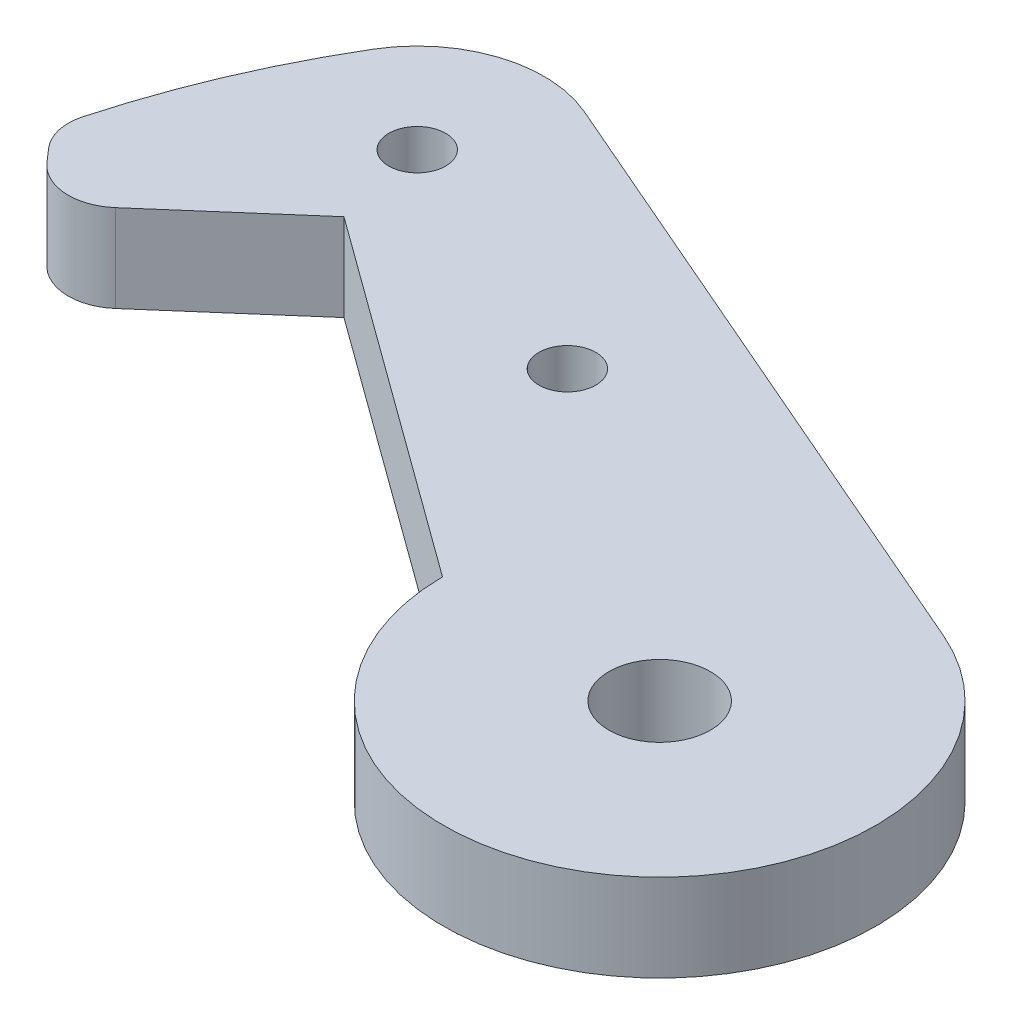
ISO-10303-21;
HEADER;
FILE_DESCRIPTION(('STEP AP214'),'2;1');
FILE_NAME('part.step','',(''),(''),'','','');
FILE_SCHEMA(('AUTOMOTIVE_DESIGN { 1 0 10303 214 1 1 1 1 }'));
ENDSEC;
DATA;
#1=APPLICATION_CONTEXT('core data for automotive mechanical design processes');
#2=APPLICATION_PROTOCOL_DEFINITION('international standard','automotive_design',2000,#1);
#3=PRODUCT_CONTEXT('',#1,'mechanical');
#4=PRODUCT('Part','Part','',(#3));
#5=PRODUCT_RELATED_PRODUCT_CATEGORY('part','',(#4));
#6=PRODUCT_DEFINITION_FORMATION('','',#4);
#7=PRODUCT_DEFINITION_CONTEXT('part definition',#1,'design');
#8=PRODUCT_DEFINITION('design','',#6,#7);
#9=PRODUCT_DEFINITION_SHAPE('','',#8);
#10=(LENGTH_UNIT() NAMED_UNIT(*) SI_UNIT(.MILLI.,.METRE.));
#11=(NAMED_UNIT(*) PLANE_ANGLE_UNIT() SI_UNIT($,.RADIAN.));
#12=(NAMED_UNIT(*) SI_UNIT($,.STERADIAN.) SOLID_ANGLE_UNIT());
#13=UNCERTAINTY_MEASURE_WITH_UNIT(LENGTH_MEASURE(1.E-05),#10,'distance_accuracy_value','');
#14=(GEOMETRIC_REPRESENTATION_CONTEXT(3) GLOBAL_UNCERTAINTY_ASSIGNED_CONTEXT((#13)) GLOBAL_UNIT_ASSIGNED_CONTEXT((#10,
#11,#12)) REPRESENTATION_CONTEXT('',''));
#15=CARTESIAN_POINT('',(0.,0.,0.));
#16=DIRECTION('',(0.,0.,1.));
#17=DIRECTION('',(1.,0.,0.));
#18=AXIS2_PLACEMENT_3D('',#15,#16,#17);
#19=CARTESIAN_POINT('',(0.,5.46099999999999,0.));
#20=DIRECTION('',(0.,1.,0.));
#21=DIRECTION('',(0.,0.,1.));
#22=AXIS2_PLACEMENT_3D('',#19,#20,#21);
#23=PLANE('',#22);
#24=CARTESIAN_POINT('',(0.,5.46099999999999,0.));
#25=DIRECTION('',(0.,1.,0.));
#26=DIRECTION('',(0.,0.,1.));
#27=AXIS2_PLACEMENT_3D('',#24,#25,#26);
#28=CIRCLE('',#27,3.175);
#29=CARTESIAN_POINT('',(0.,5.46099999999999,3.175));
#30=VERTEX_POINT('',#29);
#31=EDGE_CURVE('E166',#30,#30,#28,.T.);
#32=ORIENTED_EDGE('',*,*,#31,.F.);
#33=EDGE_LOOP('',(#32));
#34=FACE_BOUND('',#33,.T.);
#35=CARTESIAN_POINT('',(0.,5.46099999999999,0.));
#36=DIRECTION('',(0.,1.,0.));
#37=DIRECTION('',(0.,0.,1.));
#38=AXIS2_PLACEMENT_3D('',#35,#36,#37);
#39=CIRCLE('',#38,13.5);
#40=CARTESIAN_POINT('',(-13.4997935259035,5.46099999999999,0.0746643018933457));
#41=VERTEX_POINT('',#40);
#42=CARTESIAN_POINT('',(5.3636388767252,5.46099999999999,-12.3887601478148));
#43=VERTEX_POINT('',#42);
#44=EDGE_CURVE('E167',#41,#43,#39,.T.);
#45=ORIENTED_EDGE('',*,*,#44,.T.);
#46=DIRECTION('',(-0.917685936875168,0.,-0.397306583461113));
#47=VECTOR('',#46,1.);
#48=CARTESIAN_POINT('',(-34.259632886346,5.46099999999999,-29.5434163293646));
#49=LINE('',#48,#47);
#50=CARTESIAN_POINT('',(-34.259632886346,5.46099999999999,-29.5434163293646));
#51=VERTEX_POINT('',#50);
#52=EDGE_CURVE('E103',#43,#51,#49,.T.);
#53=ORIENTED_EDGE('',*,*,#52,.T.);
#54=CARTESIAN_POINT('',(-37.4132538925688,5.46099999999999,-22.259284205418));
#55=DIRECTION('',(0.,1.,0.));
#56=DIRECTION('',(0.,0.,1.));
#57=AXIS2_PLACEMENT_3D('',#54,#55,#56);
#58=CIRCLE('',#57,7.93750000000001);
#59=CARTESIAN_POINT('',(-44.234733224639,5.46099999999999,-26.3177723441387));
#60=VERTEX_POINT('',#59);
#61=EDGE_CURVE('E180',#51,#60,#58,.T.);
#62=ORIENTED_EDGE('',*,*,#61,.T.);
#63=CARTESIAN_POINT('',(0.,5.46099999999999,0.));
#64=DIRECTION('',(0.,1.,0.));
#65=DIRECTION('',(0.,0.,-1.));
#66=AXIS2_PLACEMENT_3D('',#63,#64,#65);
#67=CIRCLE('',#66,51.4717083902691);
#68=CARTESIAN_POINT('',(-49.6461942024216,5.46099999999999,-13.5864699546406));
#69=VERTEX_POINT('',#68);
#70=EDGE_CURVE('E183',#60,#69,#67,.T.);
#71=ORIENTED_EDGE('',*,*,#70,.T.);
#72=CARTESIAN_POINT('',(-46.7525932852346,5.46099999999999,-12.7945900824033));
#73=DIRECTION('',(0.,1.,0.));
#74=DIRECTION('',(0.,0.,1.));
#75=AXIS2_PLACEMENT_3D('',#72,#73,#74);
#76=CIRCLE('',#75,3.);
#77=CARTESIAN_POINT('',(-49.0144111401196,5.46099999999999,-10.8237577731178));
#78=VERTEX_POINT('',#77);
#79=EDGE_CURVE('E187',#69,#78,#76,.T.);
#80=ORIENTED_EDGE('',*,*,#79,.T.);
#81=DIRECTION('',(0.656944103095169,0.,0.75393928496165));
#82=VECTOR('',#81,1.);
#83=CARTESIAN_POINT('',(-48.2986608733253,5.46099999999999,-10.0023298284638));
#84=LINE('',#83,#82);
#85=CARTESIAN_POINT('',(-48.2986608733253,5.46099999999999,-10.0023298284638));
#86=VERTEX_POINT('',#85);
#87=EDGE_CURVE('E125',#78,#86,#84,.T.);
#88=ORIENTED_EDGE('',*,*,#87,.T.);
#89=CARTESIAN_POINT('',(-45.8483581971999,5.46099999999999,-12.1373981635232));
#90=DIRECTION('',(0.,1.,0.));
#91=DIRECTION('',(0.,0.,-1.));
#92=AXIS2_PLACEMENT_3D('',#89,#90,#91);
#93=CIRCLE('',#92,3.24999999999999);
#94=CARTESIAN_POINT('',(-43.7132898621404,5.46099999999999,-9.68709548739773));
#95=VERTEX_POINT('',#94);
#96=EDGE_CURVE('E119',#86,#95,#93,.T.);
#97=ORIENTED_EDGE('',*,*,#96,.T.);
#98=DIRECTION('',(0.753939284961654,0.,-0.656944103095163));
#99=VECTOR('',#98,1.);
#100=CARTESIAN_POINT('',(-43.7132898621404,5.46099999999999,-9.68709548739773));
#101=LINE('',#100,#99);
#102=CARTESIAN_POINT('',(-36.0755531118412,5.46099999999999,-16.3422283597451));
#103=VERTEX_POINT('',#102);
#104=EDGE_CURVE('E123',#95,#103,#101,.T.);
#105=ORIENTED_EDGE('',*,*,#104,.T.);
#106=DIRECTION('',(0.808767465357848,0.,0.588128546304839));
#107=VECTOR('',#106,1.);
#108=CARTESIAN_POINT('',(-36.0755531118412,5.46099999999999,-16.3422283597451));
#109=LINE('',#108,#107);
#110=EDGE_CURVE('E57',#103,#41,#109,.T.);
#111=ORIENTED_EDGE('',*,*,#110,.T.);
#112=EDGE_LOOP('',(#45,#53,#62,#71,#80,#88,#97,#105,#111));
#113=FACE_BOUND('',#112,.T.);
#114=CARTESIAN_POINT('',(-20.8624589223985,5.46099999999999,-15.0937174914343));
#115=DIRECTION('',(0.,1.,0.));
#116=DIRECTION('',(0.,0.,1.));
#117=AXIS2_PLACEMENT_3D('',#114,#115,#116);
#118=CIRCLE('',#117,1.778);
#119=CARTESIAN_POINT('',(-20.8624589223985,5.46099999999999,-13.3157174914343));
#120=VERTEX_POINT('',#119);
#121=EDGE_CURVE('E154',#120,#120,#118,.T.);
#122=ORIENTED_EDGE('',*,*,#121,.F.);
#123=EDGE_LOOP('',(#122));
#124=FACE_BOUND('',#123,.T.);
#125=CARTESIAN_POINT('',(-37.4132538925688,5.46099999999999,-22.259284205418));
#126=DIRECTION('',(0.,1.,0.));
#127=DIRECTION('',(0.,0.,1.));
#128=AXIS2_PLACEMENT_3D('',#125,#126,#127);
#129=CIRCLE('',#128,1.778);
#130=CARTESIAN_POINT('',(-37.4132538925688,5.46099999999999,-20.4812842054179));
#131=VERTEX_POINT('',#130);
#132=EDGE_CURVE('E198',#131,#131,#129,.T.);
#133=ORIENTED_EDGE('',*,*,#132,.F.);
#134=EDGE_LOOP('',(#133));
#135=FACE_BOUND('',#134,.T.);
#136=ADVANCED_FACE('F40',(#34,#113,#124,#135),#23,.T.);
#137=CARTESIAN_POINT('',(0.,0.,0.));
#138=DIRECTION('',(0.,1.,0.));
#139=DIRECTION('',(0.,0.,1.));
#140=AXIS2_PLACEMENT_3D('',#137,#138,#139);
#141=PLANE('',#140);
#142=CARTESIAN_POINT('',(0.,0.,0.));
#143=DIRECTION('',(0.,1.,0.));
#144=DIRECTION('',(0.,0.,1.));
#145=AXIS2_PLACEMENT_3D('',#142,#143,#144);
#146=CIRCLE('',#145,13.5);
#147=CARTESIAN_POINT('',(-13.4997935259035,0.,0.0746643018933596));
#148=VERTEX_POINT('',#147);
#149=CARTESIAN_POINT('',(5.3636388767252,0.,-12.3887601478148));
#150=VERTEX_POINT('',#149);
#151=EDGE_CURVE('E160',#148,#150,#146,.T.);
#152=ORIENTED_EDGE('',*,*,#151,.F.);
#153=DIRECTION('',(0.808767465357848,0.,0.588128546304839));
#154=VECTOR('',#153,1.);
#155=CARTESIAN_POINT('',(-36.0755531118412,0.,-16.3422283597451));
#156=LINE('',#155,#154);
#157=CARTESIAN_POINT('',(-36.0755531118412,0.,-16.3422283597451));
#158=VERTEX_POINT('',#157);
#159=EDGE_CURVE('E95',#158,#148,#156,.T.);
#160=ORIENTED_EDGE('',*,*,#159,.F.);
#161=DIRECTION('',(0.753939284961654,0.,-0.656944103095163));
#162=VECTOR('',#161,1.);
#163=CARTESIAN_POINT('',(-43.7132898621404,0.,-9.68709548739773));
#164=LINE('',#163,#162);
#165=CARTESIAN_POINT('',(-43.7132898621404,0.,-9.68709548739773));
#166=VERTEX_POINT('',#165);
#167=EDGE_CURVE('E89',#166,#158,#164,.T.);
#168=ORIENTED_EDGE('',*,*,#167,.F.);
#169=CARTESIAN_POINT('',(-45.8483581971999,0.,-12.1373981635232));
#170=DIRECTION('',(0.,1.,0.));
#171=DIRECTION('',(0.,0.,-1.));
#172=AXIS2_PLACEMENT_3D('',#169,#170,#171);
#173=CIRCLE('',#172,3.24999999999999);
#174=CARTESIAN_POINT('',(-48.2986608733253,0.,-10.0023298284638));
#175=VERTEX_POINT('',#174);
#176=EDGE_CURVE('E134',#175,#166,#173,.T.);
#177=ORIENTED_EDGE('',*,*,#176,.F.);
#178=DIRECTION('',(0.656944103095169,0.,0.75393928496165));
#179=VECTOR('',#178,1.);
#180=CARTESIAN_POINT('',(-48.2986608733253,0.,-10.0023298284638));
#181=LINE('',#180,#179);
#182=CARTESIAN_POINT('',(-49.0144111401196,0.,-10.8237577731178));
#183=VERTEX_POINT('',#182);
#184=EDGE_CURVE('E273',#183,#175,#181,.T.);
#185=ORIENTED_EDGE('',*,*,#184,.F.);
#186=CARTESIAN_POINT('',(-46.7525932852346,0.,-12.7945900824032));
#187=DIRECTION('',(0.,1.,0.));
#188=DIRECTION('',(0.,0.,1.));
#189=AXIS2_PLACEMENT_3D('',#186,#187,#188);
#190=CIRCLE('',#189,3.);
#191=CARTESIAN_POINT('',(-49.6461942024216,0.,-13.5864699546406));
#192=VERTEX_POINT('',#191);
#193=EDGE_CURVE('E269',#192,#183,#190,.T.);
#194=ORIENTED_EDGE('',*,*,#193,.F.);
#195=CARTESIAN_POINT('',(0.,0.,0.));
#196=DIRECTION('',(0.,1.,0.));
#197=DIRECTION('',(0.,0.,-1.));
#198=AXIS2_PLACEMENT_3D('',#195,#196,#197);
#199=CIRCLE('',#198,51.4717083902691);
#200=CARTESIAN_POINT('',(-44.234733224639,0.,-26.3177723441387));
#201=VERTEX_POINT('',#200);
#202=EDGE_CURVE('E267',#201,#192,#199,.T.);
#203=ORIENTED_EDGE('',*,*,#202,.F.);
#204=CARTESIAN_POINT('',(-37.4132538925688,0.,-22.259284205418));
#205=DIRECTION('',(0.,1.,0.));
#206=DIRECTION('',(0.,0.,1.));
#207=AXIS2_PLACEMENT_3D('',#204,#205,#206);
#208=CIRCLE('',#207,7.93750000000001);
#209=CARTESIAN_POINT('',(-34.259632886346,0.,-29.5434163293646));
#210=VERTEX_POINT('',#209);
#211=EDGE_CURVE('E259',#210,#201,#208,.T.);
#212=ORIENTED_EDGE('',*,*,#211,.F.);
#213=DIRECTION('',(-0.917685936875168,0.,-0.397306583461113));
#214=VECTOR('',#213,1.);
#215=CARTESIAN_POINT('',(-34.259632886346,0.,-29.5434163293646));
#216=LINE('',#215,#214);
#217=EDGE_CURVE('E252',#150,#210,#216,.T.);
#218=ORIENTED_EDGE('',*,*,#217,.F.);
#219=EDGE_LOOP('',(#152,#160,#168,#177,#185,#194,#203,#212,#218));
#220=FACE_BOUND('',#219,.T.);
#221=CARTESIAN_POINT('',(-20.8624589223985,0.,-15.0937174914342));
#222=DIRECTION('',(0.,1.,0.));
#223=DIRECTION('',(0.,0.,1.));
#224=AXIS2_PLACEMENT_3D('',#221,#222,#223);
#225=CIRCLE('',#224,1.778);
#226=CARTESIAN_POINT('',(-20.8624589223985,0.,-13.3157174914342));
#227=VERTEX_POINT('',#226);
#228=EDGE_CURVE('E161',#227,#227,#225,.T.);
#229=ORIENTED_EDGE('',*,*,#228,.T.);
#230=EDGE_LOOP('',(#229));
#231=FACE_BOUND('',#230,.T.);
#232=CARTESIAN_POINT('',(0.,0.,0.));
#233=DIRECTION('',(0.,1.,0.));
#234=DIRECTION('',(0.,0.,1.));
#235=AXIS2_PLACEMENT_3D('',#232,#233,#234);
#236=CIRCLE('',#235,3.175);
#237=CARTESIAN_POINT('',(0.,0.,3.175));
#238=VERTEX_POINT('',#237);
#239=EDGE_CURVE('E162',#238,#238,#236,.T.);
#240=ORIENTED_EDGE('',*,*,#239,.T.);
#241=EDGE_LOOP('',(#240));
#242=FACE_BOUND('',#241,.T.);
#243=CARTESIAN_POINT('',(-37.4132538925688,0.,-22.259284205418));
#244=DIRECTION('',(0.,1.,0.));
#245=DIRECTION('',(0.,0.,1.));
#246=AXIS2_PLACEMENT_3D('',#243,#244,#245);
#247=CIRCLE('',#246,1.778);
#248=CARTESIAN_POINT('',(-37.4132538925688,0.,-20.4812842054179));
#249=VERTEX_POINT('',#248);
#250=EDGE_CURVE('E201',#249,#249,#247,.T.);
#251=ORIENTED_EDGE('',*,*,#250,.T.);
#252=EDGE_LOOP('',(#251));
#253=FACE_BOUND('',#252,.T.);
#254=ADVANCED_FACE('F212',(#220,#231,#242,#253),#141,.F.);
#255=CARTESIAN_POINT('',(0.,5.46099999999999,0.));
#256=DIRECTION('',(0.,-1.,0.));
#257=DIRECTION('',(0.,0.,-1.));
#258=AXIS2_PLACEMENT_3D('',#255,#256,#257);
#259=CYLINDRICAL_SURFACE('',#258,13.5);
#260=ORIENTED_EDGE('',*,*,#151,.T.);
#261=DIRECTION('',(0.,-1.,0.));
#262=VECTOR('',#261,1.);
#263=CARTESIAN_POINT('',(5.3636388767252,5.46099999999999,-12.3887601478148));
#264=LINE('',#263,#262);
#265=EDGE_CURVE('E12',#43,#150,#264,.T.);
#266=ORIENTED_EDGE('',*,*,#265,.F.);
#267=ORIENTED_EDGE('',*,*,#44,.F.);
#268=DIRECTION('',(0.,-1.,0.));
#269=VECTOR('',#268,1.);
#270=CARTESIAN_POINT('',(-13.4997935259035,5.46099999999999,0.0746643018933457));
#271=LINE('',#270,#269);
#272=EDGE_CURVE('E142',#41,#148,#271,.T.);
#273=ORIENTED_EDGE('',*,*,#272,.T.);
#274=EDGE_LOOP('',(#260,#266,#267,#273));
#275=FACE_BOUND('',#274,.T.);
#276=ADVANCED_FACE('F42',(#275),#259,.T.);
#277=CARTESIAN_POINT('',(-34.259632886346,5.46099999999999,-29.5434163293646));
#278=DIRECTION('',(-0.397306583461113,0.,0.917685936875168));
#279=DIRECTION('',(0.917685936875169,0.,0.397306583461113));
#280=AXIS2_PLACEMENT_3D('',#277,#278,#279);
#281=PLANE('',#280);
#282=ORIENTED_EDGE('',*,*,#217,.T.);
#283=DIRECTION('',(0.,-1.,0.));
#284=VECTOR('',#283,1.);
#285=CARTESIAN_POINT('',(-34.259632886346,5.46099999999999,-29.5434163293646));
#286=LINE('',#285,#284);
#287=EDGE_CURVE('E49',#51,#210,#286,.T.);
#288=ORIENTED_EDGE('',*,*,#287,.F.);
#289=ORIENTED_EDGE('',*,*,#52,.F.);
#290=ORIENTED_EDGE('',*,*,#265,.T.);
#291=EDGE_LOOP('',(#282,#288,#289,#290));
#292=FACE_BOUND('',#291,.T.);
#293=ADVANCED_FACE('F245',(#292),#281,.F.);
#294=CARTESIAN_POINT('',(-37.4132538925688,5.46099999999999,-22.259284205418));
#295=DIRECTION('',(0.,-1.,0.));
#296=DIRECTION('',(0.,0.,-1.));
#297=AXIS2_PLACEMENT_3D('',#294,#295,#296);
#298=CYLINDRICAL_SURFACE('',#297,7.93750000000001);
#299=ORIENTED_EDGE('',*,*,#211,.T.);
#300=DIRECTION('',(0.,-1.,0.));
#301=VECTOR('',#300,1.);
#302=CARTESIAN_POINT('',(-44.234733224639,5.46099999999999,-26.3177723441387));
#303=LINE('',#302,#301);
#304=EDGE_CURVE('E263',#60,#201,#303,.T.);
#305=ORIENTED_EDGE('',*,*,#304,.F.);
#306=ORIENTED_EDGE('',*,*,#61,.F.);
#307=ORIENTED_EDGE('',*,*,#287,.T.);
#308=EDGE_LOOP('',(#299,#305,#306,#307));
#309=FACE_BOUND('',#308,.T.);
#310=ADVANCED_FACE('F242',(#309),#298,.T.);
#311=CARTESIAN_POINT('',(0.,5.46099999999999,0.));
#312=DIRECTION('',(0.,-1.,0.));
#313=DIRECTION('',(0.,0.,-1.));
#314=AXIS2_PLACEMENT_3D('',#311,#312,#313);
#315=CYLINDRICAL_SURFACE('',#314,51.4717083902691);
#316=ORIENTED_EDGE('',*,*,#202,.T.);
#317=DIRECTION('',(0.,-1.,0.));
#318=VECTOR('',#317,1.);
#319=CARTESIAN_POINT('',(-49.6461942024216,5.46099999999999,-13.5864699546406));
#320=LINE('',#319,#318);
#321=EDGE_CURVE('E284',#69,#192,#320,.T.);
#322=ORIENTED_EDGE('',*,*,#321,.F.);
#323=ORIENTED_EDGE('',*,*,#70,.F.);
#324=ORIENTED_EDGE('',*,*,#304,.T.);
#325=EDGE_LOOP('',(#316,#322,#323,#324));
#326=FACE_BOUND('',#325,.T.);
#327=ADVANCED_FACE('F238',(#326),#315,.T.);
#328=CARTESIAN_POINT('',(-46.7525932852346,5.46099999999999,-12.7945900824033));
#329=DIRECTION('',(0.,-1.,0.));
#330=DIRECTION('',(0.,0.,-1.));
#331=AXIS2_PLACEMENT_3D('',#328,#329,#330);
#332=CYLINDRICAL_SURFACE('',#331,3.);
#333=ORIENTED_EDGE('',*,*,#193,.T.);
#334=DIRECTION('',(0.,-1.,0.));
#335=VECTOR('',#334,1.);
#336=CARTESIAN_POINT('',(-49.0144111401196,5.46099999999999,-10.8237577731178));
#337=LINE('',#336,#335);
#338=EDGE_CURVE('E281',#78,#183,#337,.T.);
#339=ORIENTED_EDGE('',*,*,#338,.F.);
#340=ORIENTED_EDGE('',*,*,#79,.F.);
#341=ORIENTED_EDGE('',*,*,#321,.T.);
#342=EDGE_LOOP('',(#333,#339,#340,#341));
#343=FACE_BOUND('',#342,.T.);
#344=ADVANCED_FACE('F234',(#343),#332,.T.);
#345=CARTESIAN_POINT('',(-48.2986608733253,5.46099999999999,-10.0023298284638));
#346=DIRECTION('',(0.75393928496165,0.,-0.656944103095169));
#347=DIRECTION('',(-0.656944103095169,0.,-0.75393928496165));
#348=AXIS2_PLACEMENT_3D('',#345,#346,#347);
#349=PLANE('',#348);
#350=ORIENTED_EDGE('',*,*,#184,.T.);
#351=DIRECTION('',(0.,-1.,0.));
#352=VECTOR('',#351,1.);
#353=CARTESIAN_POINT('',(-48.2986608733253,5.46099999999999,-10.0023298284638));
#354=LINE('',#353,#352);
#355=EDGE_CURVE('E135',#86,#175,#354,.T.);
#356=ORIENTED_EDGE('',*,*,#355,.F.);
#357=ORIENTED_EDGE('',*,*,#87,.F.);
#358=ORIENTED_EDGE('',*,*,#338,.T.);
#359=EDGE_LOOP('',(#350,#356,#357,#358));
#360=FACE_BOUND('',#359,.T.);
#361=ADVANCED_FACE('F231',(#360),#349,.F.);
#362=CARTESIAN_POINT('',(-45.8483581971999,5.46099999999999,-12.1373981635232));
#363=DIRECTION('',(0.,-1.,0.));
#364=DIRECTION('',(0.,0.,-1.));
#365=AXIS2_PLACEMENT_3D('',#362,#363,#364);
#366=CYLINDRICAL_SURFACE('',#365,3.24999999999999);
#367=ORIENTED_EDGE('',*,*,#176,.T.);
#368=DIRECTION('',(0.,-1.,0.));
#369=VECTOR('',#368,1.);
#370=CARTESIAN_POINT('',(-43.7132898621404,5.46099999999999,-9.68709548739773));
#371=LINE('',#370,#369);
#372=EDGE_CURVE('E131',#95,#166,#371,.T.);
#373=ORIENTED_EDGE('',*,*,#372,.F.);
#374=ORIENTED_EDGE('',*,*,#96,.F.);
#375=ORIENTED_EDGE('',*,*,#355,.T.);
#376=EDGE_LOOP('',(#367,#373,#374,#375));
#377=FACE_BOUND('',#376,.T.);
#378=ADVANCED_FACE('F132',(#377),#366,.T.);
#379=CARTESIAN_POINT('',(-43.7132898621404,5.46099999999999,-9.68709548739773));
#380=DIRECTION('',(-0.656944103095163,0.,-0.753939284961654));
#381=DIRECTION('',(-0.753939284961654,0.,0.656944103095163));
#382=AXIS2_PLACEMENT_3D('',#379,#380,#381);
#383=PLANE('',#382);
#384=ORIENTED_EDGE('',*,*,#167,.T.);
#385=DIRECTION('',(0.,-1.,0.));
#386=VECTOR('',#385,1.);
#387=CARTESIAN_POINT('',(-36.0755531118412,5.46099999999999,-16.3422283597451));
#388=LINE('',#387,#386);
#389=EDGE_CURVE('E136',#103,#158,#388,.T.);
#390=ORIENTED_EDGE('',*,*,#389,.F.);
#391=ORIENTED_EDGE('',*,*,#104,.F.);
#392=ORIENTED_EDGE('',*,*,#372,.T.);
#393=EDGE_LOOP('',(#384,#390,#391,#392));
#394=FACE_BOUND('',#393,.T.);
#395=ADVANCED_FACE('F138',(#394),#383,.F.);
#396=CARTESIAN_POINT('',(-36.0755531118412,5.46099999999999,-16.3422283597451));
#397=DIRECTION('',(0.588128546304839,0.,-0.808767465357847));
#398=DIRECTION('',(-0.808767465357847,0.,-0.588128546304839));
#399=AXIS2_PLACEMENT_3D('',#396,#397,#398);
#400=PLANE('',#399);
#401=ORIENTED_EDGE('',*,*,#159,.T.);
#402=ORIENTED_EDGE('',*,*,#272,.F.);
#403=ORIENTED_EDGE('',*,*,#110,.F.);
#404=ORIENTED_EDGE('',*,*,#389,.T.);
#405=EDGE_LOOP('',(#401,#402,#403,#404));
#406=FACE_BOUND('',#405,.T.);
#407=ADVANCED_FACE('F224',(#406),#400,.F.);
#408=CARTESIAN_POINT('',(-20.8624589223985,5.46099999999999,-15.0937174914343));
#409=DIRECTION('',(0.,-1.,0.));
#410=DIRECTION('',(0.,0.,-1.));
#411=AXIS2_PLACEMENT_3D('',#408,#409,#410);
#412=CYLINDRICAL_SURFACE('',#411,1.778);
#413=ORIENTED_EDGE('',*,*,#121,.T.);
#414=EDGE_LOOP('',(#413));
#415=FACE_BOUND('',#414,.T.);
#416=ORIENTED_EDGE('',*,*,#228,.F.);
#417=EDGE_LOOP('',(#416));
#418=FACE_BOUND('',#417,.T.);
#419=ADVANCED_FACE('F221',(#415,#418),#412,.F.);
#420=CARTESIAN_POINT('',(0.,5.46099999999999,0.));
#421=DIRECTION('',(0.,-1.,0.));
#422=DIRECTION('',(0.,0.,-1.));
#423=AXIS2_PLACEMENT_3D('',#420,#421,#422);
#424=CYLINDRICAL_SURFACE('',#423,3.175);
#425=ORIENTED_EDGE('',*,*,#31,.T.);
#426=EDGE_LOOP('',(#425));
#427=FACE_BOUND('',#426,.T.);
#428=ORIENTED_EDGE('',*,*,#239,.F.);
#429=EDGE_LOOP('',(#428));
#430=FACE_BOUND('',#429,.T.);
#431=ADVANCED_FACE('F299',(#427,#430),#424,.F.);
#432=CARTESIAN_POINT('',(-37.4132538925688,5.46099999999999,-22.259284205418));
#433=DIRECTION('',(0.,-1.,0.));
#434=DIRECTION('',(0.,0.,-1.));
#435=AXIS2_PLACEMENT_3D('',#432,#433,#434);
#436=CYLINDRICAL_SURFACE('',#435,1.778);
#437=ORIENTED_EDGE('',*,*,#132,.T.);
#438=EDGE_LOOP('',(#437));
#439=FACE_BOUND('',#438,.T.);
#440=ORIENTED_EDGE('',*,*,#250,.F.);
#441=EDGE_LOOP('',(#440));
#442=FACE_BOUND('',#441,.T.);
#443=ADVANCED_FACE('F208',(#439,#442),#436,.F.);
#444=CLOSED_SHELL('',(#136,#254,#276,#293,#310,#327,#344,#361,#378,#395,#407,#419,#431,#443));
#445=MANIFOLD_SOLID_BREP('B2',#444);
#446=ADVANCED_BREP_SHAPE_REPRESENTATION('',(#18,#445),#14);
#447=SHAPE_DEFINITION_REPRESENTATION(#9,#446);
ENDSEC;
END-ISO-10303-21;
